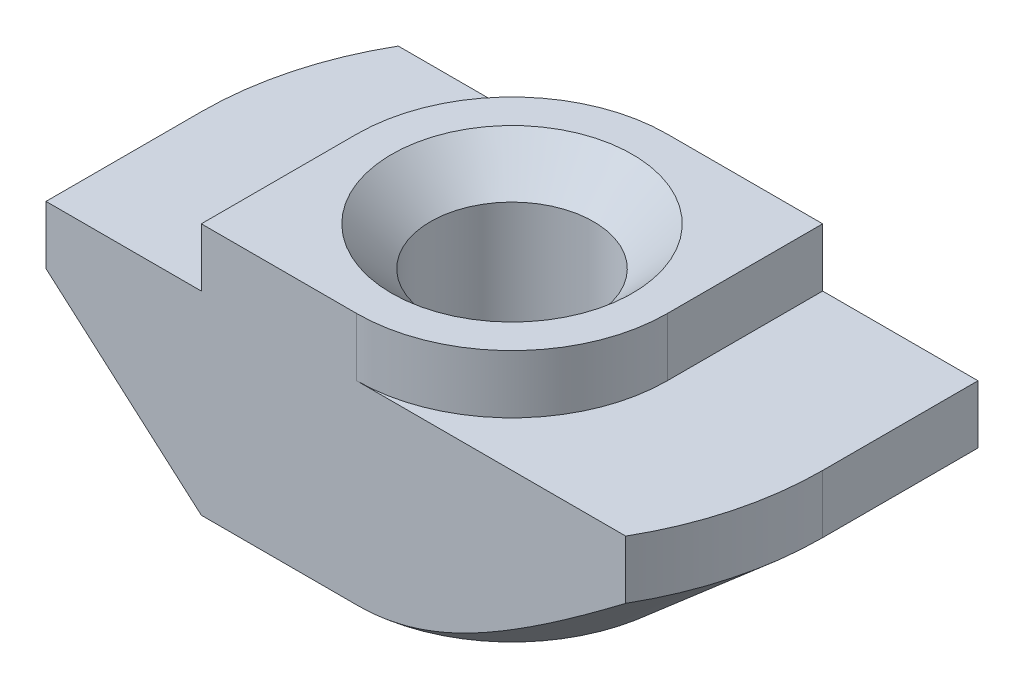
ISO-10303-21;
HEADER;
FILE_DESCRIPTION(('STEP AP214'),'2;1');
FILE_NAME('part.step','',(''),(''),'','','');
FILE_SCHEMA(('AUTOMOTIVE_DESIGN { 1 0 10303 214 1 1 1 1 }'));
ENDSEC;
DATA;
#1=APPLICATION_CONTEXT('core data for automotive mechanical design processes');
#2=APPLICATION_PROTOCOL_DEFINITION('international standard','automotive_design',2000,#1);
#3=PRODUCT_CONTEXT('',#1,'mechanical');
#4=PRODUCT('Part','Part','',(#3));
#5=PRODUCT_RELATED_PRODUCT_CATEGORY('part','',(#4));
#6=PRODUCT_DEFINITION_FORMATION('','',#4);
#7=PRODUCT_DEFINITION_CONTEXT('part definition',#1,'design');
#8=PRODUCT_DEFINITION('design','',#6,#7);
#9=PRODUCT_DEFINITION_SHAPE('','',#8);
#10=(LENGTH_UNIT() NAMED_UNIT(*) SI_UNIT(.MILLI.,.METRE.));
#11=(NAMED_UNIT(*) PLANE_ANGLE_UNIT() SI_UNIT($,.RADIAN.));
#12=(NAMED_UNIT(*) SI_UNIT($,.STERADIAN.) SOLID_ANGLE_UNIT());
#13=UNCERTAINTY_MEASURE_WITH_UNIT(LENGTH_MEASURE(1.E-05),#10,'distance_accuracy_value','');
#14=(GEOMETRIC_REPRESENTATION_CONTEXT(3) GLOBAL_UNCERTAINTY_ASSIGNED_CONTEXT((#13)) GLOBAL_UNIT_ASSIGNED_CONTEXT((#10,
#11,#12)) REPRESENTATION_CONTEXT('',''));
#15=CARTESIAN_POINT('',(0.,0.,0.));
#16=DIRECTION('',(0.,0.,1.));
#17=DIRECTION('',(1.,0.,0.));
#18=AXIS2_PLACEMENT_3D('',#15,#16,#17);
#19=CARTESIAN_POINT('',(-8.,-1.5,4.));
#20=DIRECTION('',(1.,0.,0.));
#21=DIRECTION('',(0.,0.,-1.));
#22=AXIS2_PLACEMENT_3D('',#19,#20,#21);
#23=PLANE('',#22);
#24=DIRECTION('',(0.,0.,-1.));
#25=VECTOR('',#24,1.);
#26=CARTESIAN_POINT('',(-8.,-3.,4.));
#27=LINE('',#26,#25);
#28=CARTESIAN_POINT('',(-8.,-3.,4.));
#29=VERTEX_POINT('',#28);
#30=CARTESIAN_POINT('',(-8.,-3.,0.));
#31=VERTEX_POINT('',#30);
#32=EDGE_CURVE('E316',#29,#31,#27,.T.);
#33=ORIENTED_EDGE('',*,*,#32,.F.);
#34=DIRECTION('',(0.,-1.,0.));
#35=VECTOR('',#34,1.);
#36=CARTESIAN_POINT('',(-8.,-1.5,4.));
#37=LINE('',#36,#35);
#38=CARTESIAN_POINT('',(-8.,-1.5,4.));
#39=VERTEX_POINT('',#38);
#40=EDGE_CURVE('E163',#39,#29,#37,.T.);
#41=ORIENTED_EDGE('',*,*,#40,.F.);
#42=DIRECTION('',(0.,0.,-1.));
#43=VECTOR('',#42,1.);
#44=CARTESIAN_POINT('',(-8.,-1.5,4.));
#45=LINE('',#44,#43);
#46=CARTESIAN_POINT('',(-8.,-1.5,0.));
#47=VERTEX_POINT('',#46);
#48=EDGE_CURVE('E45',#39,#47,#45,.T.);
#49=ORIENTED_EDGE('',*,*,#48,.T.);
#50=DIRECTION('',(0.,1.,0.));
#51=VECTOR('',#50,1.);
#52=CARTESIAN_POINT('',(-8.,-6.5,0.));
#53=LINE('',#52,#51);
#54=EDGE_CURVE('E209',#31,#47,#53,.T.);
#55=ORIENTED_EDGE('',*,*,#54,.F.);
#56=EDGE_LOOP('',(#33,#41,#49,#55));
#57=FACE_BOUND('',#56,.T.);
#58=ADVANCED_FACE('F37',(#57),#23,.F.);
#59=CARTESIAN_POINT('',(-8.,-6.5,4.));
#60=DIRECTION('',(0.,1.,0.));
#61=DIRECTION('',(0.,0.,1.));
#62=AXIS2_PLACEMENT_3D('',#59,#60,#61);
#63=PLANE('',#62);
#64=CARTESIAN_POINT('',(0.,-6.5,0.));
#65=DIRECTION('',(0.,1.,0.));
#66=DIRECTION('',(0.,0.,1.));
#67=AXIS2_PLACEMENT_3D('',#64,#65,#66);
#68=CIRCLE('',#67,3.1);
#69=CARTESIAN_POINT('',(0.,-6.5,3.1));
#70=VERTEX_POINT('',#69);
#71=EDGE_CURVE('E258',#70,#70,#68,.T.);
#72=ORIENTED_EDGE('',*,*,#71,.T.);
#73=EDGE_LOOP('',(#72));
#74=FACE_BOUND('',#73,.T.);
#75=DIRECTION('',(1.,0.,0.));
#76=VECTOR('',#75,1.);
#77=CARTESIAN_POINT('',(-8.,-6.5,4.));
#78=LINE('',#77,#76);
#79=CARTESIAN_POINT('',(-4.,-6.5,4.));
#80=VERTEX_POINT('',#79);
#81=CARTESIAN_POINT('',(0.,-6.5,4.));
#82=VERTEX_POINT('',#81);
#83=EDGE_CURVE('E161',#80,#82,#78,.T.);
#84=ORIENTED_EDGE('',*,*,#83,.F.);
#85=DIRECTION('',(0.,0.,-1.));
#86=VECTOR('',#85,1.);
#87=CARTESIAN_POINT('',(-4.,-6.5,4.));
#88=LINE('',#87,#86);
#89=CARTESIAN_POINT('',(-4.,-6.5,0.));
#90=VERTEX_POINT('',#89);
#91=EDGE_CURVE('E146',#80,#90,#88,.T.);
#92=ORIENTED_EDGE('',*,*,#91,.T.);
#93=CARTESIAN_POINT('',(0.,-6.5,0.));
#94=DIRECTION('',(0.,-1.,0.));
#95=DIRECTION('',(-1.,0.,0.));
#96=AXIS2_PLACEMENT_3D('',#93,#94,#95);
#97=CIRCLE('',#96,4.);
#98=CARTESIAN_POINT('',(0.,-6.5,-4.));
#99=VERTEX_POINT('',#98);
#100=EDGE_CURVE('E317',#90,#99,#97,.T.);
#101=ORIENTED_EDGE('',*,*,#100,.T.);
#102=DIRECTION('',(1.,0.,0.));
#103=VECTOR('',#102,1.);
#104=CARTESIAN_POINT('',(-8.,-6.5,-4.));
#105=LINE('',#104,#103);
#106=CARTESIAN_POINT('',(4.,-6.5,-4.));
#107=VERTEX_POINT('',#106);
#108=EDGE_CURVE('E181',#99,#107,#105,.T.);
#109=ORIENTED_EDGE('',*,*,#108,.T.);
#110=DIRECTION('',(0.,0.,1.));
#111=VECTOR('',#110,1.);
#112=CARTESIAN_POINT('',(4.,-6.5,-8.));
#113=LINE('',#112,#111);
#114=CARTESIAN_POINT('',(4.,-6.5,0.));
#115=VERTEX_POINT('',#114);
#116=EDGE_CURVE('E52',#107,#115,#113,.T.);
#117=ORIENTED_EDGE('',*,*,#116,.T.);
#118=CARTESIAN_POINT('',(0.,-6.5,0.));
#119=DIRECTION('',(0.,-1.,0.));
#120=DIRECTION('',(1.,0.,0.));
#121=AXIS2_PLACEMENT_3D('',#118,#119,#120);
#122=CIRCLE('',#121,4.);
#123=EDGE_CURVE('E167',#115,#82,#122,.T.);
#124=ORIENTED_EDGE('',*,*,#123,.T.);
#125=EDGE_LOOP('',(#84,#92,#101,#109,#117,#124));
#126=FACE_BOUND('',#125,.T.);
#127=ADVANCED_FACE('F166',(#74,#126),#63,.F.);
#128=CARTESIAN_POINT('',(8.,-1.5,4.));
#129=DIRECTION('',(-1.,0.,0.));
#130=DIRECTION('',(0.,0.,1.));
#131=AXIS2_PLACEMENT_3D('',#128,#129,#130);
#132=PLANE('',#131);
#133=DIRECTION('',(0.,0.,1.));
#134=VECTOR('',#133,1.);
#135=CARTESIAN_POINT('',(8.,-3.,-8.));
#136=LINE('',#135,#134);
#137=CARTESIAN_POINT('',(8.,-3.,-4.));
#138=VERTEX_POINT('',#137);
#139=CARTESIAN_POINT('',(8.,-3.,0.));
#140=VERTEX_POINT('',#139);
#141=EDGE_CURVE('E304',#138,#140,#136,.T.);
#142=ORIENTED_EDGE('',*,*,#141,.F.);
#143=DIRECTION('',(0.,1.,0.));
#144=VECTOR('',#143,1.);
#145=CARTESIAN_POINT('',(8.,-1.5,-4.));
#146=LINE('',#145,#144);
#147=CARTESIAN_POINT('',(8.,-1.5,-4.));
#148=VERTEX_POINT('',#147);
#149=EDGE_CURVE('E185',#138,#148,#146,.T.);
#150=ORIENTED_EDGE('',*,*,#149,.T.);
#151=DIRECTION('',(0.,0.,-1.));
#152=VECTOR('',#151,1.);
#153=CARTESIAN_POINT('',(8.,-1.5,4.));
#154=LINE('',#153,#152);
#155=CARTESIAN_POINT('',(8.,-1.5,0.));
#156=VERTEX_POINT('',#155);
#157=EDGE_CURVE('E203',#156,#148,#154,.T.);
#158=ORIENTED_EDGE('',*,*,#157,.F.);
#159=DIRECTION('',(0.,1.,0.));
#160=VECTOR('',#159,1.);
#161=CARTESIAN_POINT('',(8.,-6.5,0.));
#162=LINE('',#161,#160);
#163=EDGE_CURVE('E220',#140,#156,#162,.T.);
#164=ORIENTED_EDGE('',*,*,#163,.F.);
#165=EDGE_LOOP('',(#142,#150,#158,#164));
#166=FACE_BOUND('',#165,.T.);
#167=ADVANCED_FACE('F303',(#166),#132,.F.);
#168=CARTESIAN_POINT('',(0.,0.,4.));
#169=DIRECTION('',(0.,0.,-1.));
#170=DIRECTION('',(-1.,0.,0.));
#171=AXIS2_PLACEMENT_3D('',#168,#169,#170);
#172=PLANE('',#171);
#173=DIRECTION('',(-0.752576694706878,0.658504607868518,0.));
#174=VECTOR('',#173,1.);
#175=CARTESIAN_POINT('',(-4.,-6.5,4.));
#176=LINE('',#175,#174);
#177=EDGE_CURVE('E149',#80,#29,#176,.T.);
#178=ORIENTED_EDGE('',*,*,#177,.F.);
#179=ORIENTED_EDGE('',*,*,#83,.T.);
#180=CARTESIAN_POINT('',(14.6904905784055,3.32215914737832,4.));
#181=CARTESIAN_POINT('',(14.3847340887088,3.06403182750837,4.));
#182=CARTESIAN_POINT('',(14.0787139356754,2.80621594721695,4.));
#183=CARTESIAN_POINT('',(13.4660102927614,2.29136853816874,4.));
#184=CARTESIAN_POINT('',(13.1593267973511,2.03433701599371,4.));
#185=CARTESIAN_POINT('',(12.5450720332835,1.52114597216813,4.));
#186=CARTESIAN_POINT('',(12.2375005226594,1.26498673998448,4.));
#187=CARTESIAN_POINT('',(11.621379785589,0.753848346635908,4.));
#188=CARTESIAN_POINT('',(11.3128305625947,0.498869181312189,4.));
#189=CARTESIAN_POINT('',(10.7002145011881,-0.00491682645367106,4.));
#190=CARTESIAN_POINT('',(10.3961699625989,-0.253750767290044,4.));
#191=CARTESIAN_POINT('',(9.78659827767615,-0.749595514973884,4.));
#192=CARTESIAN_POINT('',(9.48107113722175,-0.996606329041067,4.));
#193=CARTESIAN_POINT('',(8.86814910234505,-1.48822154847088,4.));
#194=CARTESIAN_POINT('',(8.56075445261905,-1.7328262585509,4.));
#195=CARTESIAN_POINT('',(7.94347197423434,-2.21886531838598,4.));
#196=CARTESIAN_POINT('',(7.63358419509566,-2.46029973086189,4.));
#197=CARTESIAN_POINT('',(7.08115132126321,-2.88450105938665,4.));
#198=CARTESIAN_POINT('',(6.83928285358191,-3.06814795081988,4.));
#199=CARTESIAN_POINT('',(6.35294664237881,-3.43201927580775,4.));
#200=CARTESIAN_POINT('',(6.10847869152532,-3.61224343312641,4.));
#201=CARTESIAN_POINT('',(5.61348157153568,-3.97001904061898,4.));
#202=CARTESIAN_POINT('',(5.36291531280204,-4.14751931475903,4.));
#203=CARTESIAN_POINT('',(4.85727365006101,-4.49592911962344,4.));
#204=CARTESIAN_POINT('',(4.60219916319015,-4.66683996887094,4.));
#205=CARTESIAN_POINT('',(4.2130071322017,-4.91734041501033,4.));
#206=CARTESIAN_POINT('',(4.08116535064602,-5.00046374434322,4.));
#207=CARTESIAN_POINT('',(3.81562875478638,-5.16368942812443,4.));
#208=CARTESIAN_POINT('',(3.68193405117562,-5.24379196197976,4.));
#209=CARTESIAN_POINT('',(3.41220147814096,-5.40038499680941,4.));
#210=CARTESIAN_POINT('',(3.27616075326498,-5.47687059912128,4.));
#211=CARTESIAN_POINT('',(3.00156225820197,-5.62520082854102,4.));
#212=CARTESIAN_POINT('',(2.86300454546661,-5.69704556140923,4.));
#213=CARTESIAN_POINT('',(2.5849954677744,-5.83393518990307,4.));
#214=CARTESIAN_POINT('',(2.44558485527697,-5.89906227835382,4.));
#215=CARTESIAN_POINT('',(2.16361562976938,-6.02223140662004,4.));
#216=CARTESIAN_POINT('',(2.02105656760955,-6.08027242774449,4.));
#217=CARTESIAN_POINT('',(1.7329549007792,-6.18735094349871,4.));
#218=CARTESIAN_POINT('',(1.58742049089665,-6.2364102179662,4.));
#219=CARTESIAN_POINT('',(1.29316207972955,-6.32363216278026,4.));
#220=CARTESIAN_POINT('',(1.1444398948231,-6.36180086992272,4.));
#221=CARTESIAN_POINT('',(0.839100640998917,-6.42624492204711,4.));
#222=CARTESIAN_POINT('',(0.682386957719906,-6.45207249805466,4.));
#223=CARTESIAN_POINT('',(0.367144369417336,-6.48794533602483,4.));
#224=CARTESIAN_POINT('',(0.208615728897641,-6.49799286893765,4.));
#225=CARTESIAN_POINT('',(-0.108539722018433,-6.50145944673209,4.));
#226=CARTESIAN_POINT('',(-0.267166425139258,-6.49488795542754,4.));
#227=CARTESIAN_POINT('',(-0.582932728201337,-6.46570204746688,4.));
#228=CARTESIAN_POINT('',(-0.740071943547874,-6.44308359075197,4.));
#229=CARTESIAN_POINT('',(-1.09152696533888,-6.37587755691426,4.));
#230=CARTESIAN_POINT('',(-1.28504118066978,-6.32714329543957,4.));
#231=CARTESIAN_POINT('',(-1.66656634751073,-6.21161586114347,4.));
#232=CARTESIAN_POINT('',(-1.85457361936942,-6.14481090567952,4.));
#233=CARTESIAN_POINT('',(-2.22785278502951,-5.99643229439673,4.));
#234=CARTESIAN_POINT('',(-2.41304095011,-5.91465153583585,4.));
#235=CARTESIAN_POINT('',(-2.77832077795005,-5.74066303773618,4.));
#236=CARTESIAN_POINT('',(-2.95841376958414,-5.64845804888058,4.));
#237=CARTESIAN_POINT('',(-3.34961919306917,-5.43725005686976,4.));
#238=CARTESIAN_POINT('',(-3.55981165080308,-5.31655620274668,4.));
#239=CARTESIAN_POINT('',(-3.97543991863338,-5.06719713259556,4.));
#240=CARTESIAN_POINT('',(-4.18087442666426,-4.93852976912504,4.));
#241=CARTESIAN_POINT('',(-4.5882400284195,-4.67520296890076,4.));
#242=CARTESIAN_POINT('',(-4.79016601988849,-4.54053567979022,4.));
#243=CARTESIAN_POINT('',(-5.19103912814155,-4.26683396442206,4.));
#244=CARTESIAN_POINT('',(-5.38998608598997,-4.12779930637635,4.));
#245=CARTESIAN_POINT('',(-5.7725203673202,-3.8556281179886,4.));
#246=CARTESIAN_POINT('',(-5.95625882060498,-3.72270335637143,4.));
#247=CARTESIAN_POINT('',(-6.32204531106766,-3.45453802790882,4.));
#248=CARTESIAN_POINT('',(-6.50409328688208,-3.31929737750067,4.));
#249=CARTESIAN_POINT('',(-6.86616256077309,-3.04743487184612,4.));
#250=CARTESIAN_POINT('',(-7.04618870734579,-2.91081946202426,4.));
#251=CARTESIAN_POINT('',(-7.4050622812191,-2.63608068651936,4.));
#252=CARTESIAN_POINT('',(-7.58390981061062,-2.49795745427084,4.));
#253=CARTESIAN_POINT('',(-7.76228734813001,-2.35923541653878,4.));
#254=B_SPLINE_CURVE_WITH_KNOTS('',3,(#180,#181,#182,#183,#184,#185,#186,#187,#188,#189,#190,
#191,#192,#193,#194,#195,#196,#197,#198,#199,#200,#201,#202,#203,#204,#205,#206,#207,#208,#209,
#210,#211,#212,#213,#214,#215,#216,#217,#218,#219,#220,#221,#222,#223,#224,#225,#226,#227,#228,
#229,#230,#231,#232,#233,#234,#235,#236,#237,#238,#239,#240,#241,#242,#243,#244,#245,#246,#247,
#248,#249,#250,#251,#252,#253),.UNSPECIFIED.,.F.,.F.,(4,2,2,2,2,2,2,2,2,2,2,2,2,2,2,2,2,2,2,2,2,
2,2,2,2,2,2,2,2,2,2,2,2,2,2,2,4),(0.,1.20043834755379,2.40088674077275,3.60170079974658,
4.8025106235708,5.98117091859529,7.15982654353094,8.33833092623221,9.51681195828205,
10.4278547957749,11.3389708502966,12.2601049438173,13.1810537544666,13.6485968730272,
14.1161121800276,14.5842435321965,15.052364212398,15.5138255838833,15.975353217003,
16.4357464236847,16.8958839298801,17.3716429767656,17.8473335495587,18.3227532981969,
18.798292783222,19.3957954910143,19.9936887317903,20.6005786392438,21.2073087763798,
21.9341934237486,22.6612746952789,23.3893372114805,24.1174384334345,24.7977544137816,
25.4780949934672,26.1560676910982,26.8339808703156),.UNSPECIFIED.);
#255=CARTESIAN_POINT('',(6.92820323027551,-3.,4.));
#256=VERTEX_POINT('',#255);
#257=EDGE_CURVE('E321',#256,#82,#254,.T.);
#258=ORIENTED_EDGE('',*,*,#257,.F.);
#259=DIRECTION('',(0.,1.,0.));
#260=VECTOR('',#259,1.);
#261=CARTESIAN_POINT('',(6.92820323027551,-6.5,4.));
#262=LINE('',#261,#260);
#263=CARTESIAN_POINT('',(6.92820323027551,-1.5,4.));
#264=VERTEX_POINT('',#263);
#265=EDGE_CURVE('E223',#256,#264,#262,.T.);
#266=ORIENTED_EDGE('',*,*,#265,.T.);
#267=DIRECTION('',(-1.,0.,0.));
#268=VECTOR('',#267,1.);
#269=CARTESIAN_POINT('',(4.,-1.5,4.));
#270=LINE('',#269,#268);
#271=CARTESIAN_POINT('',(0.,-1.5,4.));
#272=VERTEX_POINT('',#271);
#273=EDGE_CURVE('E168',#264,#272,#270,.T.);
#274=ORIENTED_EDGE('',*,*,#273,.T.);
#275=DIRECTION('',(0.,1.,0.));
#276=VECTOR('',#275,1.);
#277=CARTESIAN_POINT('',(0.,-7.15685424949238,4.));
#278=LINE('',#277,#276);
#279=CARTESIAN_POINT('',(0.,0.,4.));
#280=VERTEX_POINT('',#279);
#281=EDGE_CURVE('E246',#272,#280,#278,.T.);
#282=ORIENTED_EDGE('',*,*,#281,.T.);
#283=DIRECTION('',(-1.,0.,0.));
#284=VECTOR('',#283,1.);
#285=CARTESIAN_POINT('',(4.,0.,4.));
#286=LINE('',#285,#284);
#287=CARTESIAN_POINT('',(-4.,0.,4.));
#288=VERTEX_POINT('',#287);
#289=EDGE_CURVE('E170',#280,#288,#286,.T.);
#290=ORIENTED_EDGE('',*,*,#289,.T.);
#291=DIRECTION('',(0.,-1.,0.));
#292=VECTOR('',#291,1.);
#293=CARTESIAN_POINT('',(-4.,0.,4.));
#294=LINE('',#293,#292);
#295=CARTESIAN_POINT('',(-4.,-1.5,4.));
#296=VERTEX_POINT('',#295);
#297=EDGE_CURVE('E196',#288,#296,#294,.T.);
#298=ORIENTED_EDGE('',*,*,#297,.T.);
#299=DIRECTION('',(-1.,0.,0.));
#300=VECTOR('',#299,1.);
#301=CARTESIAN_POINT('',(-4.,-1.5,4.));
#302=LINE('',#301,#300);
#303=EDGE_CURVE('E172',#296,#39,#302,.T.);
#304=ORIENTED_EDGE('',*,*,#303,.T.);
#305=ORIENTED_EDGE('',*,*,#40,.T.);
#306=EDGE_LOOP('',(#178,#179,#258,#266,#274,#282,#290,#298,#304,#305));
#307=FACE_BOUND('',#306,.T.);
#308=ADVANCED_FACE('F159',(#307),#172,.F.);
#309=CARTESIAN_POINT('',(0.,0.,-4.));
#310=DIRECTION('',(0.,0.,-1.));
#311=DIRECTION('',(-1.,0.,0.));
#312=AXIS2_PLACEMENT_3D('',#309,#310,#311);
#313=PLANE('',#312);
#314=ORIENTED_EDGE('',*,*,#108,.F.);
#315=CARTESIAN_POINT('',(7.76228734813001,-2.35923541653878,-4.));
#316=CARTESIAN_POINT('',(7.63797879352638,-2.45592015293055,-4.));
#317=CARTESIAN_POINT('',(7.51343705696513,-2.55230486304676,-4.));
#318=CARTESIAN_POINT('',(7.26381762684636,-2.74438155235194,-4.));
#319=CARTESIAN_POINT('',(7.13873992508832,-2.84007352088096,-4.));
#320=CARTESIAN_POINT('',(6.76245796143779,-3.12607801429787,-4.));
#321=CARTESIAN_POINT('',(6.51034969039623,-3.3152061228012,-4.));
#322=CARTESIAN_POINT('',(5.99410259404109,-3.69579382335301,-4.));
#323=CARTESIAN_POINT('',(5.72985208763481,-3.88710225926351,-4.));
#324=CARTESIAN_POINT('',(5.19695761667315,-4.26334385378289,-4.));
#325=CARTESIAN_POINT('',(4.92831530480901,-4.44827933273934,-4.));
#326=CARTESIAN_POINT('',(4.52051944159743,-4.71893396527764,-4.));
#327=CARTESIAN_POINT('',(4.38365763859022,-4.80810405751299,-4.));
#328=CARTESIAN_POINT('',(4.10812140998681,-4.98359259792687,-4.));
#329=CARTESIAN_POINT('',(3.96944707174393,-5.06991118282885,-4.));
#330=CARTESIAN_POINT('',(3.68976495223787,-5.23915159478084,-4.));
#331=CARTESIAN_POINT('',(3.5487541633338,-5.32206847356048,-4.));
#332=CARTESIAN_POINT('',(3.26422692934428,-5.48348784331378,-4.));
#333=CARTESIAN_POINT('',(3.12071056146737,-5.56199046999753,-4.));
#334=CARTESIAN_POINT('',(2.83282374140378,-5.71234353123719,-4.));
#335=CARTESIAN_POINT('',(2.68849544072785,-5.78427356099484,-4.));
#336=CARTESIAN_POINT('',(2.39663673815625,-5.92127244284365,-4.));
#337=CARTESIAN_POINT('',(2.24910576947912,-5.98634006834896,-4.));
#338=CARTESIAN_POINT('',(1.80183158618905,-6.16822752509159,-4.));
#339=CARTESIAN_POINT('',(1.49640789539285,-6.27228099552519,-4.));
#340=CARTESIAN_POINT('',(1.05233061563864,-6.38260096239082,-4.));
#341=CARTESIAN_POINT('',(0.919027463250036,-6.41066102119685,-4.));
#342=CARTESIAN_POINT('',(0.650539921788468,-6.45588615630252,-4.));
#343=CARTESIAN_POINT('',(0.51535553964587,-6.47305127272778,-4.));
#344=CARTESIAN_POINT('',(0.244416454871644,-6.49545105484671,-4.));
#345=CARTESIAN_POINT('',(0.108664879322551,-6.50072304133224,-4.));
#346=CARTESIAN_POINT('',(-0.162768146645618,-6.49911688124239,-4.));
#347=CARTESIAN_POINT('',(-0.298449596114371,-6.49223857411636,-4.));
#348=CARTESIAN_POINT('',(-0.568122439673079,-6.46681378287136,-4.));
#349=CARTESIAN_POINT('',(-0.70211852516428,-6.44831614238918,-4.));
#350=CARTESIAN_POINT('',(-0.968201604754999,-6.40073495061865,-4.));
#351=CARTESIAN_POINT('',(-1.1002884026748,-6.37165031944127,-4.));
#352=CARTESIAN_POINT('',(-1.36269157636567,-6.30410993308005,-4.));
#353=CARTESIAN_POINT('',(-1.49299633565771,-6.2656096419317,-4.));
#354=CARTESIAN_POINT('',(-1.75097360755362,-6.18078638919448,-4.));
#355=CARTESIAN_POINT('',(-1.87864668497093,-6.13446512618272,-4.));
#356=CARTESIAN_POINT('',(-2.13650460655844,-6.03336012265943,-4.));
#357=CARTESIAN_POINT('',(-2.26658470397074,-5.97831141807566,-4.));
#358=CARTESIAN_POINT('',(-2.52419349397128,-5.86250450113516,-4.));
#359=CARTESIAN_POINT('',(-2.65172159663741,-5.80174498673762,-4.));
#360=CARTESIAN_POINT('',(-2.90458369699372,-5.67553363858828,-4.));
#361=CARTESIAN_POINT('',(-3.02991533088425,-5.61007709467075,-4.));
#362=CARTESIAN_POINT('',(-3.27853105159641,-5.47537344560646,-4.));
#363=CARTESIAN_POINT('',(-3.40181492074635,-5.40612594080969,-4.));
#364=CARTESIAN_POINT('',(-3.76995033555259,-5.19320165032188,-4.));
#365=CARTESIAN_POINT('',(-4.01209636597666,-5.04485051553612,-4.));
#366=CARTESIAN_POINT('',(-4.49079845178234,-4.73976449809493,-4.));
#367=CARTESIAN_POINT('',(-4.72735731704249,-4.58303396484722,-4.));
#368=CARTESIAN_POINT('',(-5.1995516100822,-4.26136742283763,-4.));
#369=CARTESIAN_POINT('',(-5.43513045316699,-4.09634866312507,-4.));
#370=CARTESIAN_POINT('',(-5.90307692458374,-3.76178653159456,-4.));
#371=CARTESIAN_POINT('',(-6.13544419976837,-3.59224266810594,-4.));
#372=CARTESIAN_POINT('',(-6.59710196595735,-3.25019721114037,-4.));
#373=CARTESIAN_POINT('',(-6.82639861262667,-3.07770390591183,-4.));
#374=CARTESIAN_POINT('',(-7.28302678091005,-2.73013366535019,-4.));
#375=CARTESIAN_POINT('',(-7.51035827230303,-2.55505669039589,-4.));
#376=CARTESIAN_POINT('',(-8.03783315756055,-2.14507175665098,-4.));
#377=CARTESIAN_POINT('',(-8.3373766439722,-1.9093927266408,-4.));
#378=CARTESIAN_POINT('',(-8.93437099912731,-1.43539503283533,-4.));
#379=CARTESIAN_POINT('',(-9.23182183438345,-1.19707632695543,-4.));
#380=CARTESIAN_POINT('',(-9.82535128846929,-0.718219965327653,-4.));
#381=CARTESIAN_POINT('',(-10.1214285131884,-0.477680583301082,-4.));
#382=CARTESIAN_POINT('',(-10.7122981245554,0.00497082797734213,-4.));
#383=CARTESIAN_POINT('',(-11.0070905087482,0.247082860232109,-4.));
#384=CARTESIAN_POINT('',(-11.5854434366838,0.724142336197048,-4.));
#385=CARTESIAN_POINT('',(-11.8690391078616,0.959047220790179,-4.));
#386=CARTESIAN_POINT('',(-12.4354432527144,1.42980508271359,-4.));
#387=CARTESIAN_POINT('',(-12.7182517245472,1.66565806225948,-4.));
#388=CARTESIAN_POINT('',(-13.282944518856,2.13791575666086,-4.));
#389=CARTESIAN_POINT('',(-13.5648294691391,2.37431972115667,-4.));
#390=CARTESIAN_POINT('',(-14.128047944097,2.84778043170314,-4.));
#391=CARTESIAN_POINT('',(-14.4093814719245,3.08483717400299,-4.));
#392=CARTESIAN_POINT('',(-14.6904905784055,3.32215914737832,-4.));
#393=B_SPLINE_CURVE_WITH_KNOTS('',3,(#315,#316,#317,#318,#319,#320,#321,#322,#323,#324,#325,
#326,#327,#328,#329,#330,#331,#332,#333,#334,#335,#336,#337,#338,#339,#340,#341,#342,#343,#344,
#345,#346,#347,#348,#349,#350,#351,#352,#353,#354,#355,#356,#357,#358,#359,#360,#361,#362,#363,
#364,#365,#366,#367,#368,#369,#370,#371,#372,#373,#374,#375,#376,#377,#378,#379,#380,#381,#382,
#383,#384,#385,#386,#387,#388,#389,#390,#391,#392),.UNSPECIFIED.,.F.,.F.,(4,2,2,2,2,2,2,2,2,2,2,
2,2,2,2,2,2,2,2,2,2,2,2,2,2,2,2,2,2,2,2,2,2,2,2,2,2,2,4),(0.,0.472444676861442,
0.944896608343604,1.89035158415088,2.86899060339188,3.84726945941377,4.33728530856671,
4.8272776283419,5.31795911845949,5.8086255149935,6.29221715677115,6.7758950897278,
7.73984294601889,8.14815209258924,8.55645973536539,8.96348431070383,9.37051426439336,
9.77584455197681,10.1812161954516,10.5885436411454,10.9957827360295,11.4193610225933,
11.8430361185904,12.2671421774613,12.6912930327904,13.5429259149977,14.3941209613749,
15.25692369152,16.1198205533784,16.9805978250682,17.8413883107243,18.9847995557902,
20.1282290566799,21.2726382692414,22.4170496676496,23.5217921033681,24.6265371222737,
25.7302179249054,26.8338923990378),.UNSPECIFIED.);
#394=CARTESIAN_POINT('',(-6.92820323027551,-3.,-4.));
#395=VERTEX_POINT('',#394);
#396=EDGE_CURVE('E227',#99,#395,#393,.T.);
#397=ORIENTED_EDGE('',*,*,#396,.T.);
#398=DIRECTION('',(0.,1.,0.));
#399=VECTOR('',#398,1.);
#400=CARTESIAN_POINT('',(-6.92820323027551,-6.5,-4.));
#401=LINE('',#400,#399);
#402=CARTESIAN_POINT('',(-6.92820323027551,-1.5,-4.));
#403=VERTEX_POINT('',#402);
#404=EDGE_CURVE('E219',#395,#403,#401,.T.);
#405=ORIENTED_EDGE('',*,*,#404,.T.);
#406=DIRECTION('',(-1.,0.,0.));
#407=VECTOR('',#406,1.);
#408=CARTESIAN_POINT('',(-4.,-1.5,-4.));
#409=LINE('',#408,#407);
#410=CARTESIAN_POINT('',(0.,-1.5,-4.));
#411=VERTEX_POINT('',#410);
#412=EDGE_CURVE('E178',#411,#403,#409,.T.);
#413=ORIENTED_EDGE('',*,*,#412,.F.);
#414=DIRECTION('',(0.,1.,0.));
#415=VECTOR('',#414,1.);
#416=CARTESIAN_POINT('',(0.,-7.15685424949238,-4.));
#417=LINE('',#416,#415);
#418=CARTESIAN_POINT('',(0.,0.,-4.));
#419=VERTEX_POINT('',#418);
#420=EDGE_CURVE('E255',#411,#419,#417,.T.);
#421=ORIENTED_EDGE('',*,*,#420,.T.);
#422=DIRECTION('',(-1.,0.,0.));
#423=VECTOR('',#422,1.);
#424=CARTESIAN_POINT('',(4.,0.,-4.));
#425=LINE('',#424,#423);
#426=CARTESIAN_POINT('',(4.,0.,-4.));
#427=VERTEX_POINT('',#426);
#428=EDGE_CURVE('E193',#427,#419,#425,.T.);
#429=ORIENTED_EDGE('',*,*,#428,.F.);
#430=DIRECTION('',(0.,1.,0.));
#431=VECTOR('',#430,1.);
#432=CARTESIAN_POINT('',(4.,0.,-4.));
#433=LINE('',#432,#431);
#434=CARTESIAN_POINT('',(4.,-1.5,-4.));
#435=VERTEX_POINT('',#434);
#436=EDGE_CURVE('E190',#435,#427,#433,.T.);
#437=ORIENTED_EDGE('',*,*,#436,.F.);
#438=DIRECTION('',(-1.,0.,0.));
#439=VECTOR('',#438,1.);
#440=CARTESIAN_POINT('',(4.,-1.5,-4.));
#441=LINE('',#440,#439);
#442=EDGE_CURVE('E187',#148,#435,#441,.T.);
#443=ORIENTED_EDGE('',*,*,#442,.F.);
#444=ORIENTED_EDGE('',*,*,#149,.F.);
#445=DIRECTION('',(-0.752576694706878,-0.658504607868518,0.));
#446=VECTOR('',#445,1.);
#447=CARTESIAN_POINT('',(4.95575221238938,-5.66371681415929,-4.));
#448=LINE('',#447,#446);
#449=EDGE_CURVE('E313',#138,#107,#448,.T.);
#450=ORIENTED_EDGE('',*,*,#449,.T.);
#451=EDGE_LOOP('',(#314,#397,#405,#413,#421,#429,#437,#443,#444,#450));
#452=FACE_BOUND('',#451,.T.);
#453=ADVANCED_FACE('F283',(#452),#313,.T.);
#454=CARTESIAN_POINT('',(0.,-6.5,0.));
#455=DIRECTION('',(0.,1.,0.));
#456=DIRECTION('',(-1.,0.,0.));
#457=AXIS2_PLACEMENT_3D('',#454,#455,#456);
#458=CYLINDRICAL_SURFACE('',#457,8.);
#459=CARTESIAN_POINT('',(0.,-3.,0.));
#460=DIRECTION('',(0.,-1.,0.));
#461=DIRECTION('',(-1.,0.,0.));
#462=AXIS2_PLACEMENT_3D('',#459,#460,#461);
#463=CIRCLE('',#462,8.);
#464=EDGE_CURVE('E60',#31,#395,#463,.T.);
#465=ORIENTED_EDGE('',*,*,#464,.F.);
#466=ORIENTED_EDGE('',*,*,#54,.T.);
#467=CARTESIAN_POINT('',(0.,-1.5,0.));
#468=DIRECTION('',(0.,-1.,0.));
#469=DIRECTION('',(-1.,0.,0.));
#470=AXIS2_PLACEMENT_3D('',#467,#468,#469);
#471=CIRCLE('',#470,8.);
#472=EDGE_CURVE('E215',#47,#403,#471,.T.);
#473=ORIENTED_EDGE('',*,*,#472,.T.);
#474=ORIENTED_EDGE('',*,*,#404,.F.);
#475=EDGE_LOOP('',(#465,#466,#473,#474));
#476=FACE_BOUND('',#475,.T.);
#477=ADVANCED_FACE('F344',(#476),#458,.T.);
#478=CARTESIAN_POINT('',(0.,-6.5,0.));
#479=DIRECTION('',(0.,1.,0.));
#480=DIRECTION('',(-1.,0.,0.));
#481=AXIS2_PLACEMENT_3D('',#478,#479,#480);
#482=CYLINDRICAL_SURFACE('',#481,8.);
#483=CARTESIAN_POINT('',(0.,-3.,0.));
#484=DIRECTION('',(0.,-1.,0.));
#485=DIRECTION('',(1.,0.,0.));
#486=AXIS2_PLACEMENT_3D('',#483,#484,#485);
#487=CIRCLE('',#486,8.);
#488=EDGE_CURVE('E309',#140,#256,#487,.T.);
#489=ORIENTED_EDGE('',*,*,#488,.F.);
#490=ORIENTED_EDGE('',*,*,#163,.T.);
#491=CARTESIAN_POINT('',(0.,-1.5,0.));
#492=DIRECTION('',(0.,-1.,0.));
#493=DIRECTION('',(1.,0.,0.));
#494=AXIS2_PLACEMENT_3D('',#491,#492,#493);
#495=CIRCLE('',#494,8.);
#496=EDGE_CURVE('E237',#156,#264,#495,.T.);
#497=ORIENTED_EDGE('',*,*,#496,.T.);
#498=ORIENTED_EDGE('',*,*,#265,.F.);
#499=EDGE_LOOP('',(#489,#490,#497,#498));
#500=FACE_BOUND('',#499,.T.);
#501=ADVANCED_FACE('F347',(#500),#482,.T.);
#502=CARTESIAN_POINT('',(-4.,0.,4.));
#503=DIRECTION('',(1.,0.,0.));
#504=DIRECTION('',(0.,0.,-1.));
#505=AXIS2_PLACEMENT_3D('',#502,#503,#504);
#506=PLANE('',#505);
#507=DIRECTION('',(0.,0.,-1.));
#508=VECTOR('',#507,1.);
#509=CARTESIAN_POINT('',(-4.,0.,4.));
#510=LINE('',#509,#508);
#511=CARTESIAN_POINT('',(-4.,0.,0.));
#512=VERTEX_POINT('',#511);
#513=EDGE_CURVE('E177',#288,#512,#510,.T.);
#514=ORIENTED_EDGE('',*,*,#513,.T.);
#515=DIRECTION('',(0.,1.,0.));
#516=VECTOR('',#515,1.);
#517=CARTESIAN_POINT('',(-4.,-7.15685424949238,0.));
#518=LINE('',#517,#516);
#519=CARTESIAN_POINT('',(-4.,-1.5,0.));
#520=VERTEX_POINT('',#519);
#521=EDGE_CURVE('E252',#520,#512,#518,.T.);
#522=ORIENTED_EDGE('',*,*,#521,.F.);
#523=DIRECTION('',(0.,0.,-1.));
#524=VECTOR('',#523,1.);
#525=CARTESIAN_POINT('',(-4.,-1.5,4.));
#526=LINE('',#525,#524);
#527=EDGE_CURVE('E11',#296,#520,#526,.T.);
#528=ORIENTED_EDGE('',*,*,#527,.F.);
#529=ORIENTED_EDGE('',*,*,#297,.F.);
#530=EDGE_LOOP('',(#514,#522,#528,#529));
#531=FACE_BOUND('',#530,.T.);
#532=ADVANCED_FACE('F39',(#531),#506,.F.);
#533=CARTESIAN_POINT('',(-4.,-1.5,4.));
#534=DIRECTION('',(0.,-1.,0.));
#535=DIRECTION('',(1.,0.,0.));
#536=AXIS2_PLACEMENT_3D('',#533,#534,#535);
#537=PLANE('',#536);
#538=ORIENTED_EDGE('',*,*,#412,.T.);
#539=ORIENTED_EDGE('',*,*,#472,.F.);
#540=ORIENTED_EDGE('',*,*,#48,.F.);
#541=ORIENTED_EDGE('',*,*,#303,.F.);
#542=ORIENTED_EDGE('',*,*,#527,.T.);
#543=CARTESIAN_POINT('',(0.,-1.5,0.));
#544=DIRECTION('',(0.,-1.,0.));
#545=DIRECTION('',(1.,0.,0.));
#546=AXIS2_PLACEMENT_3D('',#543,#544,#545);
#547=CIRCLE('',#546,4.);
#548=EDGE_CURVE('E253',#520,#411,#547,.T.);
#549=ORIENTED_EDGE('',*,*,#548,.T.);
#550=EDGE_LOOP('',(#538,#539,#540,#541,#542,#549));
#551=FACE_BOUND('',#550,.T.);
#552=ADVANCED_FACE('F212',(#551),#537,.F.);
#553=CARTESIAN_POINT('',(4.,-1.5,4.));
#554=DIRECTION('',(0.,-1.,0.));
#555=DIRECTION('',(1.,0.,0.));
#556=AXIS2_PLACEMENT_3D('',#553,#554,#555);
#557=PLANE('',#556);
#558=ORIENTED_EDGE('',*,*,#273,.F.);
#559=ORIENTED_EDGE('',*,*,#496,.F.);
#560=ORIENTED_EDGE('',*,*,#157,.T.);
#561=ORIENTED_EDGE('',*,*,#442,.T.);
#562=DIRECTION('',(0.,0.,-1.));
#563=VECTOR('',#562,1.);
#564=CARTESIAN_POINT('',(4.,-1.5,4.));
#565=LINE('',#564,#563);
#566=CARTESIAN_POINT('',(4.,-1.5,0.));
#567=VERTEX_POINT('',#566);
#568=EDGE_CURVE('E201',#567,#435,#565,.T.);
#569=ORIENTED_EDGE('',*,*,#568,.F.);
#570=CARTESIAN_POINT('',(0.,-1.5,0.));
#571=DIRECTION('',(0.,-1.,0.));
#572=DIRECTION('',(1.,0.,0.));
#573=AXIS2_PLACEMENT_3D('',#570,#571,#572);
#574=CIRCLE('',#573,4.);
#575=EDGE_CURVE('E243',#567,#272,#574,.T.);
#576=ORIENTED_EDGE('',*,*,#575,.T.);
#577=EDGE_LOOP('',(#558,#559,#560,#561,#569,#576));
#578=FACE_BOUND('',#577,.T.);
#579=ADVANCED_FACE('F297',(#578),#557,.F.);
#580=CARTESIAN_POINT('',(4.,0.,4.));
#581=DIRECTION('',(-1.,0.,0.));
#582=DIRECTION('',(0.,0.,1.));
#583=AXIS2_PLACEMENT_3D('',#580,#581,#582);
#584=PLANE('',#583);
#585=DIRECTION('',(0.,0.,-1.));
#586=VECTOR('',#585,1.);
#587=CARTESIAN_POINT('',(4.,0.,4.));
#588=LINE('',#587,#586);
#589=CARTESIAN_POINT('',(4.,0.,0.));
#590=VERTEX_POINT('',#589);
#591=EDGE_CURVE('E199',#590,#427,#588,.T.);
#592=ORIENTED_EDGE('',*,*,#591,.F.);
#593=DIRECTION('',(0.,1.,0.));
#594=VECTOR('',#593,1.);
#595=CARTESIAN_POINT('',(4.,-7.15685424949238,0.));
#596=LINE('',#595,#594);
#597=EDGE_CURVE('E242',#567,#590,#596,.T.);
#598=ORIENTED_EDGE('',*,*,#597,.F.);
#599=ORIENTED_EDGE('',*,*,#568,.T.);
#600=ORIENTED_EDGE('',*,*,#436,.T.);
#601=EDGE_LOOP('',(#592,#598,#599,#600));
#602=FACE_BOUND('',#601,.T.);
#603=ADVANCED_FACE('F291',(#602),#584,.F.);
#604=CARTESIAN_POINT('',(4.,0.,4.));
#605=DIRECTION('',(0.,-1.,0.));
#606=DIRECTION('',(0.,0.,-1.));
#607=AXIS2_PLACEMENT_3D('',#604,#605,#606);
#608=PLANE('',#607);
#609=CARTESIAN_POINT('',(0.,0.,0.));
#610=DIRECTION('',(0.,1.,0.));
#611=DIRECTION('',(0.,0.,1.));
#612=AXIS2_PLACEMENT_3D('',#609,#610,#611);
#613=CIRCLE('',#612,3.1);
#614=CARTESIAN_POINT('',(0.,0.,3.1));
#615=VERTEX_POINT('',#614);
#616=EDGE_CURVE('E262',#615,#615,#613,.T.);
#617=ORIENTED_EDGE('',*,*,#616,.F.);
#618=EDGE_LOOP('',(#617));
#619=FACE_BOUND('',#618,.T.);
#620=ORIENTED_EDGE('',*,*,#289,.F.);
#621=CARTESIAN_POINT('',(0.,0.,0.));
#622=DIRECTION('',(0.,-1.,0.));
#623=DIRECTION('',(0.,0.,-1.));
#624=AXIS2_PLACEMENT_3D('',#621,#622,#623);
#625=CIRCLE('',#624,4.);
#626=EDGE_CURVE('E235',#590,#280,#625,.T.);
#627=ORIENTED_EDGE('',*,*,#626,.F.);
#628=ORIENTED_EDGE('',*,*,#591,.T.);
#629=ORIENTED_EDGE('',*,*,#428,.T.);
#630=CARTESIAN_POINT('',(0.,0.,0.));
#631=DIRECTION('',(0.,-1.,0.));
#632=DIRECTION('',(0.,0.,-1.));
#633=AXIS2_PLACEMENT_3D('',#630,#631,#632);
#634=CIRCLE('',#633,4.);
#635=EDGE_CURVE('E250',#512,#419,#634,.T.);
#636=ORIENTED_EDGE('',*,*,#635,.F.);
#637=ORIENTED_EDGE('',*,*,#513,.F.);
#638=EDGE_LOOP('',(#620,#627,#628,#629,#636,#637));
#639=FACE_BOUND('',#638,.T.);
#640=ADVANCED_FACE('F286',(#619,#639),#608,.F.);
#641=CARTESIAN_POINT('',(0.,-5.5,0.));
#642=DIRECTION('',(0.,-1.,0.));
#643=DIRECTION('',(0.,0.,-1.));
#644=AXIS2_PLACEMENT_3D('',#641,#642,#643);
#645=CONICAL_SURFACE('',#644,2.1,0.785398163397447);
#646=ORIENTED_EDGE('',*,*,#71,.F.);
#647=EDGE_LOOP('',(#646));
#648=FACE_BOUND('',#647,.T.);
#649=CARTESIAN_POINT('',(0.,-5.5,0.));
#650=DIRECTION('',(0.,1.,0.));
#651=DIRECTION('',(0.,0.,1.));
#652=AXIS2_PLACEMENT_3D('',#649,#650,#651);
#653=CIRCLE('',#652,2.1);
#654=CARTESIAN_POINT('',(0.,-5.5,2.1));
#655=VERTEX_POINT('',#654);
#656=EDGE_CURVE('E182',#655,#655,#653,.T.);
#657=ORIENTED_EDGE('',*,*,#656,.T.);
#658=EDGE_LOOP('',(#657));
#659=FACE_BOUND('',#658,.T.);
#660=ADVANCED_FACE('F362',(#648,#659),#645,.F.);
#661=CARTESIAN_POINT('',(0.,0.,0.));
#662=DIRECTION('',(0.,1.,0.));
#663=DIRECTION('',(0.,0.,1.));
#664=AXIS2_PLACEMENT_3D('',#661,#662,#663);
#665=CYLINDRICAL_SURFACE('',#664,2.1);
#666=ORIENTED_EDGE('',*,*,#656,.F.);
#667=EDGE_LOOP('',(#666));
#668=FACE_BOUND('',#667,.T.);
#669=CARTESIAN_POINT('',(0.,-0.999999999999998,0.));
#670=DIRECTION('',(0.,1.,0.));
#671=DIRECTION('',(0.,0.,1.));
#672=AXIS2_PLACEMENT_3D('',#669,#670,#671);
#673=CIRCLE('',#672,2.1);
#674=CARTESIAN_POINT('',(0.,-0.999999999999998,2.1));
#675=VERTEX_POINT('',#674);
#676=EDGE_CURVE('E265',#675,#675,#673,.T.);
#677=ORIENTED_EDGE('',*,*,#676,.T.);
#678=EDGE_LOOP('',(#677));
#679=FACE_BOUND('',#678,.T.);
#680=ADVANCED_FACE('F359',(#668,#679),#665,.F.);
#681=CARTESIAN_POINT('',(0.,0.,0.));
#682=DIRECTION('',(0.,1.,0.));
#683=DIRECTION('',(0.,0.,1.));
#684=AXIS2_PLACEMENT_3D('',#681,#682,#683);
#685=CONICAL_SURFACE('',#684,3.1,0.78539816339745);
#686=ORIENTED_EDGE('',*,*,#676,.F.);
#687=EDGE_LOOP('',(#686));
#688=FACE_BOUND('',#687,.T.);
#689=ORIENTED_EDGE('',*,*,#616,.T.);
#690=EDGE_LOOP('',(#689));
#691=FACE_BOUND('',#690,.T.);
#692=ADVANCED_FACE('F356',(#688,#691),#685,.F.);
#693=CARTESIAN_POINT('',(0.,-7.15685424949238,0.));
#694=DIRECTION('',(0.,1.,0.));
#695=DIRECTION('',(0.,0.,1.));
#696=AXIS2_PLACEMENT_3D('',#693,#694,#695);
#697=CYLINDRICAL_SURFACE('',#696,4.);
#698=ORIENTED_EDGE('',*,*,#521,.T.);
#699=ORIENTED_EDGE('',*,*,#635,.T.);
#700=ORIENTED_EDGE('',*,*,#420,.F.);
#701=ORIENTED_EDGE('',*,*,#548,.F.);
#702=EDGE_LOOP('',(#698,#699,#700,#701));
#703=FACE_BOUND('',#702,.T.);
#704=ADVANCED_FACE('F278',(#703),#697,.T.);
#705=CARTESIAN_POINT('',(0.,-7.15685424949238,0.));
#706=DIRECTION('',(0.,1.,0.));
#707=DIRECTION('',(0.,0.,1.));
#708=AXIS2_PLACEMENT_3D('',#705,#706,#707);
#709=CYLINDRICAL_SURFACE('',#708,4.);
#710=ORIENTED_EDGE('',*,*,#597,.T.);
#711=ORIENTED_EDGE('',*,*,#626,.T.);
#712=ORIENTED_EDGE('',*,*,#281,.F.);
#713=ORIENTED_EDGE('',*,*,#575,.F.);
#714=EDGE_LOOP('',(#710,#711,#712,#713));
#715=FACE_BOUND('',#714,.T.);
#716=ADVANCED_FACE('F339',(#715),#709,.T.);
#717=CARTESIAN_POINT('',(4.,-6.5,-8.));
#718=DIRECTION('',(0.658504607868518,-0.752576694706878,0.));
#719=DIRECTION('',(0.752576694706878,0.658504607868518,0.));
#720=AXIS2_PLACEMENT_3D('',#717,#718,#719);
#721=PLANE('',#720);
#722=ORIENTED_EDGE('',*,*,#141,.T.);
#723=DIRECTION('',(0.752576694706878,0.658504607868518,0.));
#724=VECTOR('',#723,1.);
#725=CARTESIAN_POINT('',(4.,-6.5,0.));
#726=LINE('',#725,#724);
#727=EDGE_CURVE('E306',#115,#140,#726,.T.);
#728=ORIENTED_EDGE('',*,*,#727,.F.);
#729=ORIENTED_EDGE('',*,*,#116,.F.);
#730=ORIENTED_EDGE('',*,*,#449,.F.);
#731=EDGE_LOOP('',(#722,#728,#729,#730));
#732=FACE_BOUND('',#731,.T.);
#733=ADVANCED_FACE('F334',(#732),#721,.T.);
#734=CARTESIAN_POINT('',(0.,-6.5,0.));
#735=DIRECTION('',(0.,1.,0.));
#736=DIRECTION('',(0.,0.,1.));
#737=AXIS2_PLACEMENT_3D('',#734,#735,#736);
#738=CONICAL_SURFACE('',#737,4.,0.851966327173272);
#739=ORIENTED_EDGE('',*,*,#257,.T.);
#740=ORIENTED_EDGE('',*,*,#123,.F.);
#741=ORIENTED_EDGE('',*,*,#727,.T.);
#742=ORIENTED_EDGE('',*,*,#488,.T.);
#743=EDGE_LOOP('',(#739,#740,#741,#742));
#744=FACE_BOUND('',#743,.T.);
#745=ADVANCED_FACE('F330',(#744),#738,.T.);
#746=CARTESIAN_POINT('',(-4.,-6.5,4.));
#747=DIRECTION('',(-0.658504607868518,-0.752576694706878,0.));
#748=DIRECTION('',(0.752576694706878,-0.658504607868518,0.));
#749=AXIS2_PLACEMENT_3D('',#746,#747,#748);
#750=PLANE('',#749);
#751=ORIENTED_EDGE('',*,*,#32,.T.);
#752=DIRECTION('',(-0.752576694706878,0.658504607868518,0.));
#753=VECTOR('',#752,1.);
#754=CARTESIAN_POINT('',(-4.,-6.5,0.));
#755=LINE('',#754,#753);
#756=EDGE_CURVE('E151',#90,#31,#755,.T.);
#757=ORIENTED_EDGE('',*,*,#756,.F.);
#758=ORIENTED_EDGE('',*,*,#91,.F.);
#759=ORIENTED_EDGE('',*,*,#177,.T.);
#760=EDGE_LOOP('',(#751,#757,#758,#759));
#761=FACE_BOUND('',#760,.T.);
#762=ADVANCED_FACE('F148',(#761),#750,.T.);
#763=CARTESIAN_POINT('',(0.,-6.5,0.));
#764=DIRECTION('',(0.,1.,0.));
#765=DIRECTION('',(0.,0.,1.));
#766=AXIS2_PLACEMENT_3D('',#763,#764,#765);
#767=CONICAL_SURFACE('',#766,4.,0.851966327173272);
#768=ORIENTED_EDGE('',*,*,#100,.F.);
#769=ORIENTED_EDGE('',*,*,#756,.T.);
#770=ORIENTED_EDGE('',*,*,#464,.T.);
#771=ORIENTED_EDGE('',*,*,#396,.F.);
#772=EDGE_LOOP('',(#768,#769,#770,#771));
#773=FACE_BOUND('',#772,.T.);
#774=ADVANCED_FACE('F336',(#773),#767,.T.);
#775=CLOSED_SHELL('',(#58,#127,#167,#308,#453,#477,#501,#532,#552,#579,#603,#640,#660,#680,#692,
#704,#716,#733,#745,#762,#774));
#776=MANIFOLD_SOLID_BREP('B2',#775);
#777=ADVANCED_BREP_SHAPE_REPRESENTATION('',(#18,#776),#14);
#778=SHAPE_DEFINITION_REPRESENTATION(#9,#777);
ENDSEC;
END-ISO-10303-21;
